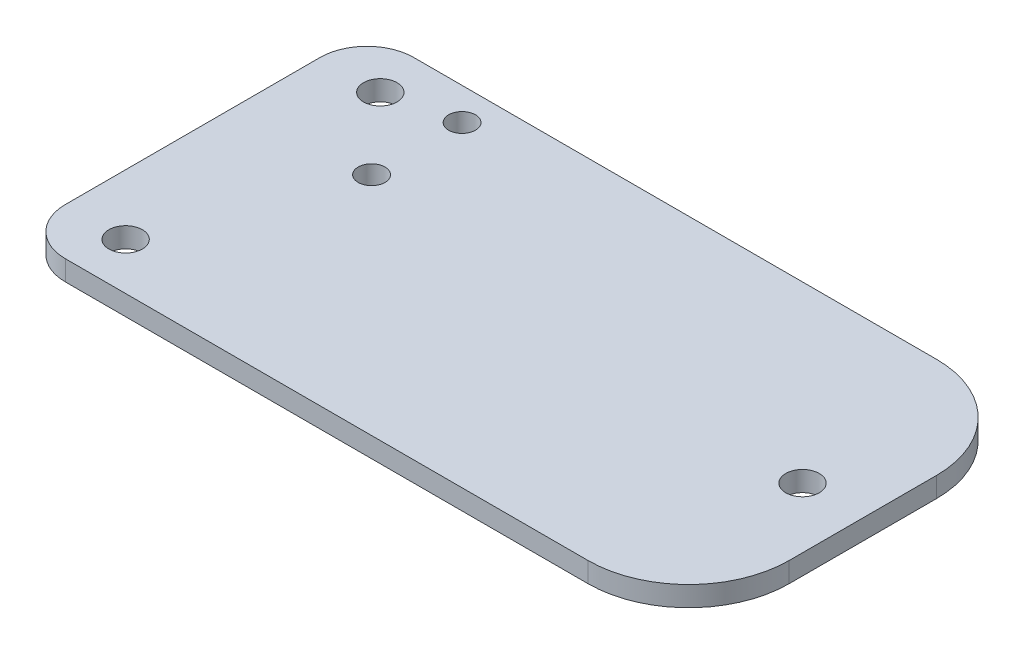
ISO-10303-21;
HEADER;
FILE_DESCRIPTION(('STEP AP214'),'2;1');
FILE_NAME('part.step','',(''),(''),'','','');
FILE_SCHEMA(('AUTOMOTIVE_DESIGN { 1 0 10303 214 1 1 1 1 }'));
ENDSEC;
DATA;
#1=APPLICATION_CONTEXT('core data for automotive mechanical design processes');
#2=APPLICATION_PROTOCOL_DEFINITION('international standard','automotive_design',2000,#1);
#3=PRODUCT_CONTEXT('',#1,'mechanical');
#4=PRODUCT('Part','Part','',(#3));
#5=PRODUCT_RELATED_PRODUCT_CATEGORY('part','',(#4));
#6=PRODUCT_DEFINITION_FORMATION('','',#4);
#7=PRODUCT_DEFINITION_CONTEXT('part definition',#1,'design');
#8=PRODUCT_DEFINITION('design','',#6,#7);
#9=PRODUCT_DEFINITION_SHAPE('','',#8);
#10=(LENGTH_UNIT() NAMED_UNIT(*) SI_UNIT(.MILLI.,.METRE.));
#11=(NAMED_UNIT(*) PLANE_ANGLE_UNIT() SI_UNIT($,.RADIAN.));
#12=(NAMED_UNIT(*) SI_UNIT($,.STERADIAN.) SOLID_ANGLE_UNIT());
#13=UNCERTAINTY_MEASURE_WITH_UNIT(LENGTH_MEASURE(1.E-05),#10,'distance_accuracy_value','');
#14=(GEOMETRIC_REPRESENTATION_CONTEXT(3) GLOBAL_UNCERTAINTY_ASSIGNED_CONTEXT((#13)) GLOBAL_UNIT_ASSIGNED_CONTEXT((#10,
#11,#12)) REPRESENTATION_CONTEXT('',''));
#15=CARTESIAN_POINT('',(0.,0.,0.));
#16=DIRECTION('',(0.,0.,1.));
#17=DIRECTION('',(1.,0.,0.));
#18=AXIS2_PLACEMENT_3D('',#15,#16,#17);
#19=CARTESIAN_POINT('',(50.,3.,0.));
#20=DIRECTION('',(1.,0.,0.));
#21=DIRECTION('',(0.,0.,-1.));
#22=AXIS2_PLACEMENT_3D('',#19,#20,#21);
#23=PLANE('',#22);
#24=DIRECTION('',(0.,0.,1.));
#25=VECTOR('',#24,1.);
#26=CARTESIAN_POINT('',(50.,0.,0.));
#27=LINE('',#26,#25);
#28=CARTESIAN_POINT('',(50.,0.,-11.));
#29=VERTEX_POINT('',#28);
#30=CARTESIAN_POINT('',(50.,0.,11.));
#31=VERTEX_POINT('',#30);
#32=EDGE_CURVE('E118',#29,#31,#27,.T.);
#33=ORIENTED_EDGE('',*,*,#32,.F.);
#34=DIRECTION('',(0.,-1.,0.));
#35=VECTOR('',#34,1.);
#36=CARTESIAN_POINT('',(50.,3.,-11.));
#37=LINE('',#36,#35);
#38=CARTESIAN_POINT('',(50.,3.,-11.));
#39=VERTEX_POINT('',#38);
#40=EDGE_CURVE('E126',#29,#39,#37,.F.);
#41=ORIENTED_EDGE('',*,*,#40,.T.);
#42=DIRECTION('',(0.,0.,1.));
#43=VECTOR('',#42,1.);
#44=CARTESIAN_POINT('',(50.,3.,0.));
#45=LINE('',#44,#43);
#46=CARTESIAN_POINT('',(50.,3.,11.));
#47=VERTEX_POINT('',#46);
#48=EDGE_CURVE('E223',#39,#47,#45,.T.);
#49=ORIENTED_EDGE('',*,*,#48,.T.);
#50=DIRECTION('',(0.,-1.,0.));
#51=VECTOR('',#50,1.);
#52=CARTESIAN_POINT('',(50.,0.,11.));
#53=LINE('',#52,#51);
#54=EDGE_CURVE('E128',#47,#31,#53,.T.);
#55=ORIENTED_EDGE('',*,*,#54,.T.);
#56=EDGE_LOOP('',(#33,#41,#49,#55));
#57=FACE_BOUND('',#56,.T.);
#58=ADVANCED_FACE('F41',(#57),#23,.T.);
#59=CARTESIAN_POINT('',(0.,3.,-26.));
#60=DIRECTION('',(0.,0.,-1.));
#61=DIRECTION('',(-1.,0.,0.));
#62=AXIS2_PLACEMENT_3D('',#59,#60,#61);
#63=PLANE('',#62);
#64=DIRECTION('',(1.,0.,0.));
#65=VECTOR('',#64,1.);
#66=CARTESIAN_POINT('',(0.,0.,-26.));
#67=LINE('',#66,#65);
#68=CARTESIAN_POINT('',(-43.,0.,-26.));
#69=VERTEX_POINT('',#68);
#70=CARTESIAN_POINT('',(35.,0.,-26.));
#71=VERTEX_POINT('',#70);
#72=EDGE_CURVE('E106',#69,#71,#67,.T.);
#73=ORIENTED_EDGE('',*,*,#72,.F.);
#74=DIRECTION('',(0.,-1.,0.));
#75=VECTOR('',#74,1.);
#76=CARTESIAN_POINT('',(-43.,3.,-26.));
#77=LINE('',#76,#75);
#78=CARTESIAN_POINT('',(-43.,3.,-26.));
#79=VERTEX_POINT('',#78);
#80=EDGE_CURVE('E11',#69,#79,#77,.F.);
#81=ORIENTED_EDGE('',*,*,#80,.T.);
#82=DIRECTION('',(1.,0.,0.));
#83=VECTOR('',#82,1.);
#84=CARTESIAN_POINT('',(0.,3.,-26.));
#85=LINE('',#84,#83);
#86=CARTESIAN_POINT('',(35.,3.,-26.));
#87=VERTEX_POINT('',#86);
#88=EDGE_CURVE('E132',#79,#87,#85,.T.);
#89=ORIENTED_EDGE('',*,*,#88,.T.);
#90=DIRECTION('',(0.,-1.,0.));
#91=VECTOR('',#90,1.);
#92=CARTESIAN_POINT('',(35.,3.,-26.));
#93=LINE('',#92,#91);
#94=EDGE_CURVE('E125',#87,#71,#93,.T.);
#95=ORIENTED_EDGE('',*,*,#94,.T.);
#96=EDGE_LOOP('',(#73,#81,#89,#95));
#97=FACE_BOUND('',#96,.T.);
#98=ADVANCED_FACE('F131',(#97),#63,.T.);
#99=CARTESIAN_POINT('',(-50.,3.,0.));
#100=DIRECTION('',(1.,0.,0.));
#101=DIRECTION('',(0.,0.,-1.));
#102=AXIS2_PLACEMENT_3D('',#99,#100,#101);
#103=PLANE('',#102);
#104=DIRECTION('',(0.,0.,1.));
#105=VECTOR('',#104,1.);
#106=CARTESIAN_POINT('',(-50.,0.,0.));
#107=LINE('',#106,#105);
#108=CARTESIAN_POINT('',(-50.,0.,-19.));
#109=VERTEX_POINT('',#108);
#110=CARTESIAN_POINT('',(-50.,0.,19.));
#111=VERTEX_POINT('',#110);
#112=EDGE_CURVE('E117',#109,#111,#107,.T.);
#113=ORIENTED_EDGE('',*,*,#112,.T.);
#114=DIRECTION('',(0.,-1.,0.));
#115=VECTOR('',#114,1.);
#116=CARTESIAN_POINT('',(-50.,3.,19.));
#117=LINE('',#116,#115);
#118=CARTESIAN_POINT('',(-50.,3.,19.));
#119=VERTEX_POINT('',#118);
#120=EDGE_CURVE('E63',#111,#119,#117,.F.);
#121=ORIENTED_EDGE('',*,*,#120,.T.);
#122=DIRECTION('',(0.,0.,1.));
#123=VECTOR('',#122,1.);
#124=CARTESIAN_POINT('',(-50.,3.,0.));
#125=LINE('',#124,#123);
#126=CARTESIAN_POINT('',(-50.,3.,-19.));
#127=VERTEX_POINT('',#126);
#128=EDGE_CURVE('E141',#127,#119,#125,.T.);
#129=ORIENTED_EDGE('',*,*,#128,.F.);
#130=DIRECTION('',(0.,-1.,0.));
#131=VECTOR('',#130,1.);
#132=CARTESIAN_POINT('',(-50.,0.,-19.));
#133=LINE('',#132,#131);
#134=EDGE_CURVE('E171',#127,#109,#133,.T.);
#135=ORIENTED_EDGE('',*,*,#134,.T.);
#136=EDGE_LOOP('',(#113,#121,#129,#135));
#137=FACE_BOUND('',#136,.T.);
#138=ADVANCED_FACE('F191',(#137),#103,.F.);
#139=CARTESIAN_POINT('',(41.,3.,0.));
#140=DIRECTION('',(0.,-1.,0.));
#141=DIRECTION('',(0.,0.,-1.));
#142=AXIS2_PLACEMENT_3D('',#139,#140,#141);
#143=CYLINDRICAL_SURFACE('',#142,2.5);
#144=CARTESIAN_POINT('',(41.,3.,0.));
#145=DIRECTION('',(0.,1.,0.));
#146=DIRECTION('',(0.,0.,1.));
#147=AXIS2_PLACEMENT_3D('',#144,#145,#146);
#148=CIRCLE('',#147,2.5);
#149=CARTESIAN_POINT('',(41.,3.,2.5));
#150=VERTEX_POINT('',#149);
#151=EDGE_CURVE('E227',#150,#150,#148,.T.);
#152=ORIENTED_EDGE('',*,*,#151,.T.);
#153=EDGE_LOOP('',(#152));
#154=FACE_BOUND('',#153,.T.);
#155=CARTESIAN_POINT('',(41.,0.,0.));
#156=DIRECTION('',(0.,1.,0.));
#157=DIRECTION('',(0.,0.,1.));
#158=AXIS2_PLACEMENT_3D('',#155,#156,#157);
#159=CIRCLE('',#158,2.5);
#160=CARTESIAN_POINT('',(41.,0.,2.5));
#161=VERTEX_POINT('',#160);
#162=EDGE_CURVE('E199',#161,#161,#159,.T.);
#163=ORIENTED_EDGE('',*,*,#162,.F.);
#164=EDGE_LOOP('',(#163));
#165=FACE_BOUND('',#164,.T.);
#166=ADVANCED_FACE('F261',(#154,#165),#143,.F.);
#167=CARTESIAN_POINT('',(-41.,3.,19.));
#168=DIRECTION('',(0.,-1.,0.));
#169=DIRECTION('',(0.,0.,-1.));
#170=AXIS2_PLACEMENT_3D('',#167,#168,#169);
#171=CYLINDRICAL_SURFACE('',#170,2.5);
#172=CARTESIAN_POINT('',(-41.,3.,19.));
#173=DIRECTION('',(0.,1.,0.));
#174=DIRECTION('',(0.,0.,1.));
#175=AXIS2_PLACEMENT_3D('',#172,#173,#174);
#176=CIRCLE('',#175,2.5);
#177=CARTESIAN_POINT('',(-41.,3.,21.5));
#178=VERTEX_POINT('',#177);
#179=EDGE_CURVE('E231',#178,#178,#176,.T.);
#180=ORIENTED_EDGE('',*,*,#179,.T.);
#181=EDGE_LOOP('',(#180));
#182=FACE_BOUND('',#181,.T.);
#183=CARTESIAN_POINT('',(-41.,0.,19.));
#184=DIRECTION('',(0.,1.,0.));
#185=DIRECTION('',(0.,0.,1.));
#186=AXIS2_PLACEMENT_3D('',#183,#184,#185);
#187=CIRCLE('',#186,2.5);
#188=CARTESIAN_POINT('',(-41.,0.,21.5));
#189=VERTEX_POINT('',#188);
#190=EDGE_CURVE('E203',#189,#189,#187,.T.);
#191=ORIENTED_EDGE('',*,*,#190,.F.);
#192=EDGE_LOOP('',(#191));
#193=FACE_BOUND('',#192,.T.);
#194=ADVANCED_FACE('F264',(#182,#193),#171,.F.);
#195=CARTESIAN_POINT('',(-31.,3.,-21.2));
#196=DIRECTION('',(0.,-1.,0.));
#197=DIRECTION('',(0.,0.,-1.));
#198=AXIS2_PLACEMENT_3D('',#195,#196,#197);
#199=CYLINDRICAL_SURFACE('',#198,2.);
#200=CARTESIAN_POINT('',(-31.,3.,-21.2));
#201=DIRECTION('',(0.,1.,0.));
#202=DIRECTION('',(0.,0.,1.));
#203=AXIS2_PLACEMENT_3D('',#200,#201,#202);
#204=CIRCLE('',#203,2.);
#205=CARTESIAN_POINT('',(-31.,3.,-19.2));
#206=VERTEX_POINT('',#205);
#207=EDGE_CURVE('E235',#206,#206,#204,.T.);
#208=ORIENTED_EDGE('',*,*,#207,.T.);
#209=EDGE_LOOP('',(#208));
#210=FACE_BOUND('',#209,.T.);
#211=CARTESIAN_POINT('',(-31.,0.,-21.2));
#212=DIRECTION('',(0.,1.,0.));
#213=DIRECTION('',(0.,0.,1.));
#214=AXIS2_PLACEMENT_3D('',#211,#212,#213);
#215=CIRCLE('',#214,2.);
#216=CARTESIAN_POINT('',(-31.,0.,-19.2));
#217=VERTEX_POINT('',#216);
#218=EDGE_CURVE('E207',#217,#217,#215,.T.);
#219=ORIENTED_EDGE('',*,*,#218,.F.);
#220=EDGE_LOOP('',(#219));
#221=FACE_BOUND('',#220,.T.);
#222=ADVANCED_FACE('F289',(#210,#221),#199,.F.);
#223=CARTESIAN_POINT('',(-31.,3.,-7.7));
#224=DIRECTION('',(0.,-1.,0.));
#225=DIRECTION('',(0.,0.,-1.));
#226=AXIS2_PLACEMENT_3D('',#223,#224,#225);
#227=CYLINDRICAL_SURFACE('',#226,2.);
#228=CARTESIAN_POINT('',(-31.,3.,-7.7));
#229=DIRECTION('',(0.,1.,0.));
#230=DIRECTION('',(0.,0.,1.));
#231=AXIS2_PLACEMENT_3D('',#228,#229,#230);
#232=CIRCLE('',#231,2.);
#233=CARTESIAN_POINT('',(-31.,3.,-5.7));
#234=VERTEX_POINT('',#233);
#235=EDGE_CURVE('E239',#234,#234,#232,.T.);
#236=ORIENTED_EDGE('',*,*,#235,.T.);
#237=EDGE_LOOP('',(#236));
#238=FACE_BOUND('',#237,.T.);
#239=CARTESIAN_POINT('',(-31.,0.,-7.7));
#240=DIRECTION('',(0.,1.,0.));
#241=DIRECTION('',(0.,0.,1.));
#242=AXIS2_PLACEMENT_3D('',#239,#240,#241);
#243=CIRCLE('',#242,2.);
#244=CARTESIAN_POINT('',(-31.,0.,-5.7));
#245=VERTEX_POINT('',#244);
#246=EDGE_CURVE('E211',#245,#245,#243,.T.);
#247=ORIENTED_EDGE('',*,*,#246,.F.);
#248=EDGE_LOOP('',(#247));
#249=FACE_BOUND('',#248,.T.);
#250=ADVANCED_FACE('F293',(#238,#249),#227,.F.);
#251=CARTESIAN_POINT('',(-41.,3.,-19.));
#252=DIRECTION('',(0.,-1.,0.));
#253=DIRECTION('',(0.,0.,-1.));
#254=AXIS2_PLACEMENT_3D('',#251,#252,#253);
#255=CYLINDRICAL_SURFACE('',#254,2.5);
#256=CARTESIAN_POINT('',(-41.,3.,-19.));
#257=DIRECTION('',(0.,1.,0.));
#258=DIRECTION('',(0.,0.,1.));
#259=AXIS2_PLACEMENT_3D('',#256,#257,#258);
#260=CIRCLE('',#259,2.5);
#261=CARTESIAN_POINT('',(-41.,3.,-16.5));
#262=VERTEX_POINT('',#261);
#263=EDGE_CURVE('E195',#262,#262,#260,.T.);
#264=ORIENTED_EDGE('',*,*,#263,.T.);
#265=EDGE_LOOP('',(#264));
#266=FACE_BOUND('',#265,.T.);
#267=CARTESIAN_POINT('',(-41.,0.,-19.));
#268=DIRECTION('',(0.,1.,0.));
#269=DIRECTION('',(0.,0.,1.));
#270=AXIS2_PLACEMENT_3D('',#267,#268,#269);
#271=CIRCLE('',#270,2.5);
#272=CARTESIAN_POINT('',(-41.,0.,-16.5));
#273=VERTEX_POINT('',#272);
#274=EDGE_CURVE('E215',#273,#273,#271,.T.);
#275=ORIENTED_EDGE('',*,*,#274,.F.);
#276=EDGE_LOOP('',(#275));
#277=FACE_BOUND('',#276,.T.);
#278=ADVANCED_FACE('F247',(#266,#277),#255,.F.);
#279=CARTESIAN_POINT('',(0.,3.,26.));
#280=DIRECTION('',(0.,0.,-1.));
#281=DIRECTION('',(-1.,0.,0.));
#282=AXIS2_PLACEMENT_3D('',#279,#280,#281);
#283=PLANE('',#282);
#284=DIRECTION('',(1.,0.,0.));
#285=VECTOR('',#284,1.);
#286=CARTESIAN_POINT('',(0.,3.,26.));
#287=LINE('',#286,#285);
#288=CARTESIAN_POINT('',(-43.,3.,26.));
#289=VERTEX_POINT('',#288);
#290=CARTESIAN_POINT('',(35.,3.,26.));
#291=VERTEX_POINT('',#290);
#292=EDGE_CURVE('E135',#289,#291,#287,.T.);
#293=ORIENTED_EDGE('',*,*,#292,.F.);
#294=DIRECTION('',(0.,-1.,0.));
#295=VECTOR('',#294,1.);
#296=CARTESIAN_POINT('',(-43.,3.,26.));
#297=LINE('',#296,#295);
#298=CARTESIAN_POINT('',(-43.,0.,26.));
#299=VERTEX_POINT('',#298);
#300=EDGE_CURVE('E162',#289,#299,#297,.T.);
#301=ORIENTED_EDGE('',*,*,#300,.T.);
#302=DIRECTION('',(1.,0.,0.));
#303=VECTOR('',#302,1.);
#304=CARTESIAN_POINT('',(0.,0.,26.));
#305=LINE('',#304,#303);
#306=CARTESIAN_POINT('',(35.,0.,26.));
#307=VERTEX_POINT('',#306);
#308=EDGE_CURVE('E144',#299,#307,#305,.T.);
#309=ORIENTED_EDGE('',*,*,#308,.T.);
#310=DIRECTION('',(0.,-1.,0.));
#311=VECTOR('',#310,1.);
#312=CARTESIAN_POINT('',(35.,3.,26.));
#313=LINE('',#312,#311);
#314=EDGE_CURVE('E158',#307,#291,#313,.F.);
#315=ORIENTED_EDGE('',*,*,#314,.T.);
#316=EDGE_LOOP('',(#293,#301,#309,#315));
#317=FACE_BOUND('',#316,.T.);
#318=ADVANCED_FACE('F187',(#317),#283,.F.);
#319=CARTESIAN_POINT('',(0.,3.,0.));
#320=DIRECTION('',(0.,1.,0.));
#321=DIRECTION('',(0.,0.,1.));
#322=AXIS2_PLACEMENT_3D('',#319,#320,#321);
#323=PLANE('',#322);
#324=ORIENTED_EDGE('',*,*,#263,.F.);
#325=EDGE_LOOP('',(#324));
#326=FACE_BOUND('',#325,.T.);
#327=ORIENTED_EDGE('',*,*,#235,.F.);
#328=EDGE_LOOP('',(#327));
#329=FACE_BOUND('',#328,.T.);
#330=ORIENTED_EDGE('',*,*,#207,.F.);
#331=EDGE_LOOP('',(#330));
#332=FACE_BOUND('',#331,.T.);
#333=ORIENTED_EDGE('',*,*,#179,.F.);
#334=EDGE_LOOP('',(#333));
#335=FACE_BOUND('',#334,.T.);
#336=ORIENTED_EDGE('',*,*,#151,.F.);
#337=EDGE_LOOP('',(#336));
#338=FACE_BOUND('',#337,.T.);
#339=ORIENTED_EDGE('',*,*,#128,.T.);
#340=CARTESIAN_POINT('',(-43.,3.,19.));
#341=DIRECTION('',(0.,1.,0.));
#342=DIRECTION('',(0.,0.,1.));
#343=AXIS2_PLACEMENT_3D('',#340,#341,#342);
#344=CIRCLE('',#343,7.);
#345=EDGE_CURVE('E50',#119,#289,#344,.T.);
#346=ORIENTED_EDGE('',*,*,#345,.T.);
#347=ORIENTED_EDGE('',*,*,#292,.T.);
#348=CARTESIAN_POINT('',(35.,3.,11.));
#349=DIRECTION('',(0.,1.,0.));
#350=DIRECTION('',(0.,0.,1.));
#351=AXIS2_PLACEMENT_3D('',#348,#349,#350);
#352=CIRCLE('',#351,15.);
#353=EDGE_CURVE('E152',#291,#47,#352,.T.);
#354=ORIENTED_EDGE('',*,*,#353,.T.);
#355=ORIENTED_EDGE('',*,*,#48,.F.);
#356=CARTESIAN_POINT('',(35.,3.,-11.));
#357=DIRECTION('',(0.,1.,0.));
#358=DIRECTION('',(0.,0.,1.));
#359=AXIS2_PLACEMENT_3D('',#356,#357,#358);
#360=CIRCLE('',#359,15.);
#361=EDGE_CURVE('E155',#39,#87,#360,.T.);
#362=ORIENTED_EDGE('',*,*,#361,.T.);
#363=ORIENTED_EDGE('',*,*,#88,.F.);
#364=CARTESIAN_POINT('',(-43.,3.,-19.));
#365=DIRECTION('',(0.,1.,0.));
#366=DIRECTION('',(0.,0.,1.));
#367=AXIS2_PLACEMENT_3D('',#364,#365,#366);
#368=CIRCLE('',#367,7.);
#369=EDGE_CURVE('E177',#79,#127,#368,.T.);
#370=ORIENTED_EDGE('',*,*,#369,.T.);
#371=EDGE_LOOP('',(#339,#346,#347,#354,#355,#362,#363,#370));
#372=FACE_BOUND('',#371,.T.);
#373=ADVANCED_FACE('F183',(#326,#329,#332,#335,#338,#372),#323,.T.);
#374=CARTESIAN_POINT('',(0.,0.,0.));
#375=DIRECTION('',(0.,1.,0.));
#376=DIRECTION('',(0.,0.,1.));
#377=AXIS2_PLACEMENT_3D('',#374,#375,#376);
#378=PLANE('',#377);
#379=ORIENTED_EDGE('',*,*,#274,.T.);
#380=EDGE_LOOP('',(#379));
#381=FACE_BOUND('',#380,.T.);
#382=ORIENTED_EDGE('',*,*,#246,.T.);
#383=EDGE_LOOP('',(#382));
#384=FACE_BOUND('',#383,.T.);
#385=ORIENTED_EDGE('',*,*,#218,.T.);
#386=EDGE_LOOP('',(#385));
#387=FACE_BOUND('',#386,.T.);
#388=ORIENTED_EDGE('',*,*,#190,.T.);
#389=EDGE_LOOP('',(#388));
#390=FACE_BOUND('',#389,.T.);
#391=ORIENTED_EDGE('',*,*,#162,.T.);
#392=EDGE_LOOP('',(#391));
#393=FACE_BOUND('',#392,.T.);
#394=ORIENTED_EDGE('',*,*,#308,.F.);
#395=CARTESIAN_POINT('',(-43.,0.,19.));
#396=DIRECTION('',(0.,1.,0.));
#397=DIRECTION('',(0.,0.,1.));
#398=AXIS2_PLACEMENT_3D('',#395,#396,#397);
#399=CIRCLE('',#398,7.);
#400=EDGE_CURVE('E168',#299,#111,#399,.F.);
#401=ORIENTED_EDGE('',*,*,#400,.T.);
#402=ORIENTED_EDGE('',*,*,#112,.F.);
#403=CARTESIAN_POINT('',(-43.,0.,-19.));
#404=DIRECTION('',(0.,1.,0.));
#405=DIRECTION('',(0.,0.,1.));
#406=AXIS2_PLACEMENT_3D('',#403,#404,#405);
#407=CIRCLE('',#406,7.);
#408=EDGE_CURVE('E114',#109,#69,#407,.F.);
#409=ORIENTED_EDGE('',*,*,#408,.T.);
#410=ORIENTED_EDGE('',*,*,#72,.T.);
#411=CARTESIAN_POINT('',(35.,0.,-11.));
#412=DIRECTION('',(0.,1.,0.));
#413=DIRECTION('',(0.,0.,1.));
#414=AXIS2_PLACEMENT_3D('',#411,#412,#413);
#415=CIRCLE('',#414,15.);
#416=EDGE_CURVE('E111',#71,#29,#415,.F.);
#417=ORIENTED_EDGE('',*,*,#416,.T.);
#418=ORIENTED_EDGE('',*,*,#32,.T.);
#419=CARTESIAN_POINT('',(35.,0.,11.));
#420=DIRECTION('',(0.,1.,0.));
#421=DIRECTION('',(0.,0.,1.));
#422=AXIS2_PLACEMENT_3D('',#419,#420,#421);
#423=CIRCLE('',#422,15.);
#424=EDGE_CURVE('E129',#31,#307,#423,.F.);
#425=ORIENTED_EDGE('',*,*,#424,.T.);
#426=EDGE_LOOP('',(#394,#401,#402,#409,#410,#417,#418,#425));
#427=FACE_BOUND('',#426,.T.);
#428=ADVANCED_FACE('F109',(#381,#384,#387,#390,#393,#427),#378,.F.);
#429=CARTESIAN_POINT('',(35.,3.,-11.));
#430=DIRECTION('',(0.,-1.,0.));
#431=DIRECTION('',(0.,0.,-1.));
#432=AXIS2_PLACEMENT_3D('',#429,#430,#431);
#433=CYLINDRICAL_SURFACE('',#432,15.);
#434=ORIENTED_EDGE('',*,*,#361,.F.);
#435=ORIENTED_EDGE('',*,*,#40,.F.);
#436=ORIENTED_EDGE('',*,*,#416,.F.);
#437=ORIENTED_EDGE('',*,*,#94,.F.);
#438=EDGE_LOOP('',(#434,#435,#436,#437));
#439=FACE_BOUND('',#438,.T.);
#440=ADVANCED_FACE('F124',(#439),#433,.T.);
#441=CARTESIAN_POINT('',(35.,3.,11.));
#442=DIRECTION('',(0.,1.,0.));
#443=DIRECTION('',(0.,0.,1.));
#444=AXIS2_PLACEMENT_3D('',#441,#442,#443);
#445=CYLINDRICAL_SURFACE('',#444,15.);
#446=ORIENTED_EDGE('',*,*,#353,.F.);
#447=ORIENTED_EDGE('',*,*,#314,.F.);
#448=ORIENTED_EDGE('',*,*,#424,.F.);
#449=ORIENTED_EDGE('',*,*,#54,.F.);
#450=EDGE_LOOP('',(#446,#447,#448,#449));
#451=FACE_BOUND('',#450,.T.);
#452=ADVANCED_FACE('F274',(#451),#445,.T.);
#453=CARTESIAN_POINT('',(-43.,3.,19.));
#454=DIRECTION('',(0.,-1.,0.));
#455=DIRECTION('',(0.,0.,-1.));
#456=AXIS2_PLACEMENT_3D('',#453,#454,#455);
#457=CYLINDRICAL_SURFACE('',#456,7.);
#458=ORIENTED_EDGE('',*,*,#345,.F.);
#459=ORIENTED_EDGE('',*,*,#120,.F.);
#460=ORIENTED_EDGE('',*,*,#400,.F.);
#461=ORIENTED_EDGE('',*,*,#300,.F.);
#462=EDGE_LOOP('',(#458,#459,#460,#461));
#463=FACE_BOUND('',#462,.T.);
#464=ADVANCED_FACE('F190',(#463),#457,.T.);
#465=CARTESIAN_POINT('',(-43.,3.,-19.));
#466=DIRECTION('',(0.,1.,0.));
#467=DIRECTION('',(0.,0.,1.));
#468=AXIS2_PLACEMENT_3D('',#465,#466,#467);
#469=CYLINDRICAL_SURFACE('',#468,7.);
#470=ORIENTED_EDGE('',*,*,#369,.F.);
#471=ORIENTED_EDGE('',*,*,#80,.F.);
#472=ORIENTED_EDGE('',*,*,#408,.F.);
#473=ORIENTED_EDGE('',*,*,#134,.F.);
#474=EDGE_LOOP('',(#470,#471,#472,#473));
#475=FACE_BOUND('',#474,.T.);
#476=ADVANCED_FACE('F43',(#475),#469,.T.);
#477=CLOSED_SHELL('',(#58,#98,#138,#166,#194,#222,#250,#278,#318,#373,#428,#440,#452,#464,#476));
#478=MANIFOLD_SOLID_BREP('B2',#477);
#479=ADVANCED_BREP_SHAPE_REPRESENTATION('',(#18,#478),#14);
#480=SHAPE_DEFINITION_REPRESENTATION(#9,#479);
ENDSEC;
END-ISO-10303-21;
